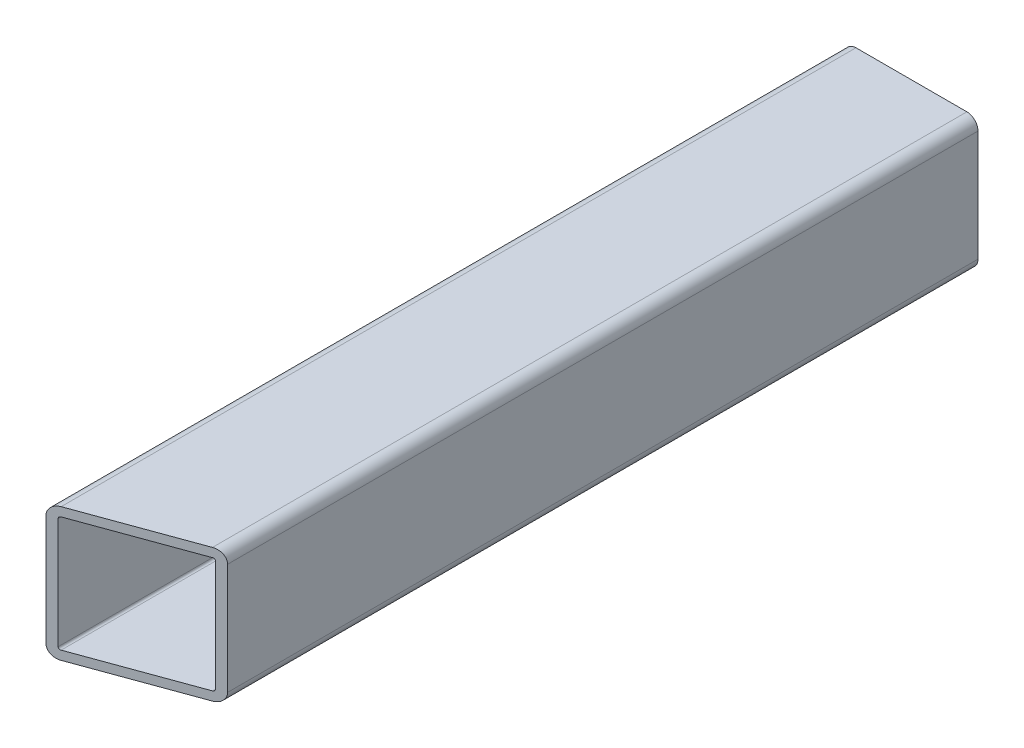
ISO-10303-21;
HEADER;
FILE_DESCRIPTION(('STEP AP214'),'2;1');
FILE_NAME('part.step','',(''),(''),'','','');
FILE_SCHEMA(('AUTOMOTIVE_DESIGN { 1 0 10303 214 1 1 1 1 }'));
ENDSEC;
DATA;
#1=APPLICATION_CONTEXT('core data for automotive mechanical design processes');
#2=APPLICATION_PROTOCOL_DEFINITION('international standard','automotive_design',2000,#1);
#3=PRODUCT_CONTEXT('',#1,'mechanical');
#4=PRODUCT('Part','Part','',(#3));
#5=PRODUCT_RELATED_PRODUCT_CATEGORY('part','',(#4));
#6=PRODUCT_DEFINITION_FORMATION('','',#4);
#7=PRODUCT_DEFINITION_CONTEXT('part definition',#1,'design');
#8=PRODUCT_DEFINITION('design','',#6,#7);
#9=PRODUCT_DEFINITION_SHAPE('','',#8);
#10=(LENGTH_UNIT() NAMED_UNIT(*) SI_UNIT(.MILLI.,.METRE.));
#11=(NAMED_UNIT(*) PLANE_ANGLE_UNIT() SI_UNIT($,.RADIAN.));
#12=(NAMED_UNIT(*) SI_UNIT($,.STERADIAN.) SOLID_ANGLE_UNIT());
#13=UNCERTAINTY_MEASURE_WITH_UNIT(LENGTH_MEASURE(1.E-05),#10,'distance_accuracy_value','');
#14=(GEOMETRIC_REPRESENTATION_CONTEXT(3) GLOBAL_UNCERTAINTY_ASSIGNED_CONTEXT((#13)) GLOBAL_UNIT_ASSIGNED_CONTEXT((#10,
#11,#12)) REPRESENTATION_CONTEXT('',''));
#15=CARTESIAN_POINT('',(0.,0.,0.));
#16=DIRECTION('',(0.,0.,1.));
#17=DIRECTION('',(1.,0.,0.));
#18=AXIS2_PLACEMENT_3D('',#15,#16,#17);
#19=CARTESIAN_POINT('',(-15.875,-15.875,-114.3));
#20=DIRECTION('',(0.,0.,1.));
#21=DIRECTION('',(1.,0.,0.));
#22=AXIS2_PLACEMENT_3D('',#19,#20,#21);
#23=PLANE('',#22);
#24=CARTESIAN_POINT('',(-15.875,-15.875,-114.3));
#25=DIRECTION('',(0.,0.,1.));
#26=DIRECTION('',(1.,0.,0.));
#27=AXIS2_PLACEMENT_3D('',#24,#25,#26);
#28=CIRCLE('',#27,3.175);
#29=CARTESIAN_POINT('',(-19.05,-15.875,-114.3));
#30=VERTEX_POINT('',#29);
#31=CARTESIAN_POINT('',(-15.875,-19.05,-114.3));
#32=VERTEX_POINT('',#31);
#33=EDGE_CURVE('E224',#30,#32,#28,.T.);
#34=ORIENTED_EDGE('',*,*,#33,.F.);
#35=DIRECTION('',(0.,-1.,0.));
#36=VECTOR('',#35,1.);
#37=CARTESIAN_POINT('',(-19.05,15.875,-114.3));
#38=LINE('',#37,#36);
#39=CARTESIAN_POINT('',(-19.05,15.875,-114.3));
#40=VERTEX_POINT('',#39);
#41=EDGE_CURVE('E203',#40,#30,#38,.T.);
#42=ORIENTED_EDGE('',*,*,#41,.F.);
#43=CARTESIAN_POINT('',(-15.875,15.875,-114.3));
#44=DIRECTION('',(0.,0.,1.));
#45=DIRECTION('',(1.,0.,0.));
#46=AXIS2_PLACEMENT_3D('',#43,#44,#45);
#47=CIRCLE('',#46,3.175);
#48=CARTESIAN_POINT('',(-15.875,19.05,-114.3));
#49=VERTEX_POINT('',#48);
#50=EDGE_CURVE('E218',#49,#40,#47,.T.);
#51=ORIENTED_EDGE('',*,*,#50,.F.);
#52=DIRECTION('',(-1.,0.,0.));
#53=VECTOR('',#52,1.);
#54=CARTESIAN_POINT('',(-15.875,19.05,-114.3));
#55=LINE('',#54,#53);
#56=CARTESIAN_POINT('',(15.875,19.05,-114.3));
#57=VERTEX_POINT('',#56);
#58=EDGE_CURVE('E238',#57,#49,#55,.T.);
#59=ORIENTED_EDGE('',*,*,#58,.F.);
#60=CARTESIAN_POINT('',(15.875,15.875,-114.3));
#61=DIRECTION('',(0.,0.,1.));
#62=DIRECTION('',(1.,0.,0.));
#63=AXIS2_PLACEMENT_3D('',#60,#61,#62);
#64=CIRCLE('',#63,3.175);
#65=CARTESIAN_POINT('',(19.05,15.875,-114.3));
#66=VERTEX_POINT('',#65);
#67=EDGE_CURVE('E235',#66,#57,#64,.T.);
#68=ORIENTED_EDGE('',*,*,#67,.F.);
#69=DIRECTION('',(0.,1.,0.));
#70=VECTOR('',#69,1.);
#71=CARTESIAN_POINT('',(19.05,15.875,-114.3));
#72=LINE('',#71,#70);
#73=CARTESIAN_POINT('',(19.05,-15.875,-114.3));
#74=VERTEX_POINT('',#73);
#75=EDGE_CURVE('E232',#74,#66,#72,.T.);
#76=ORIENTED_EDGE('',*,*,#75,.F.);
#77=CARTESIAN_POINT('',(15.875,-15.875,-114.3));
#78=DIRECTION('',(0.,0.,1.));
#79=DIRECTION('',(1.,0.,0.));
#80=AXIS2_PLACEMENT_3D('',#77,#78,#79);
#81=CIRCLE('',#80,3.175);
#82=CARTESIAN_POINT('',(15.875,-19.05,-114.3));
#83=VERTEX_POINT('',#82);
#84=EDGE_CURVE('E229',#83,#74,#81,.T.);
#85=ORIENTED_EDGE('',*,*,#84,.F.);
#86=DIRECTION('',(1.,0.,0.));
#87=VECTOR('',#86,1.);
#88=CARTESIAN_POINT('',(-15.875,-19.05,-114.3));
#89=LINE('',#88,#87);
#90=EDGE_CURVE('E226',#32,#83,#89,.T.);
#91=ORIENTED_EDGE('',*,*,#90,.F.);
#92=EDGE_LOOP('',(#34,#42,#51,#59,#68,#76,#85,#91));
#93=FACE_BOUND('',#92,.T.);
#94=CARTESIAN_POINT('',(-15.875,-15.875,-114.3));
#95=DIRECTION('',(0.,0.,1.));
#96=DIRECTION('',(1.,0.,0.));
#97=AXIS2_PLACEMENT_3D('',#94,#95,#96);
#98=CIRCLE('',#97,0.635000000000002);
#99=CARTESIAN_POINT('',(-16.51,-15.875,-114.3));
#100=VERTEX_POINT('',#99);
#101=CARTESIAN_POINT('',(-15.875,-16.51,-114.3));
#102=VERTEX_POINT('',#101);
#103=EDGE_CURVE('E212',#100,#102,#98,.T.);
#104=ORIENTED_EDGE('',*,*,#103,.T.);
#105=DIRECTION('',(1.,0.,0.));
#106=VECTOR('',#105,1.);
#107=CARTESIAN_POINT('',(-15.875,-16.51,-114.3));
#108=LINE('',#107,#106);
#109=CARTESIAN_POINT('',(15.875,-16.51,-114.3));
#110=VERTEX_POINT('',#109);
#111=EDGE_CURVE('E268',#102,#110,#108,.T.);
#112=ORIENTED_EDGE('',*,*,#111,.T.);
#113=CARTESIAN_POINT('',(15.875,-15.875,-114.3));
#114=DIRECTION('',(0.,0.,1.));
#115=DIRECTION('',(1.,0.,0.));
#116=AXIS2_PLACEMENT_3D('',#113,#114,#115);
#117=CIRCLE('',#116,0.634999999999999);
#118=CARTESIAN_POINT('',(16.51,-15.875,-114.3));
#119=VERTEX_POINT('',#118);
#120=EDGE_CURVE('E271',#110,#119,#117,.T.);
#121=ORIENTED_EDGE('',*,*,#120,.T.);
#122=DIRECTION('',(0.,1.,0.));
#123=VECTOR('',#122,1.);
#124=CARTESIAN_POINT('',(16.51,15.875,-114.3));
#125=LINE('',#124,#123);
#126=CARTESIAN_POINT('',(16.51,15.875,-114.3));
#127=VERTEX_POINT('',#126);
#128=EDGE_CURVE('E274',#119,#127,#125,.T.);
#129=ORIENTED_EDGE('',*,*,#128,.T.);
#130=CARTESIAN_POINT('',(15.875,15.875,-114.3));
#131=DIRECTION('',(0.,0.,1.));
#132=DIRECTION('',(1.,0.,0.));
#133=AXIS2_PLACEMENT_3D('',#130,#131,#132);
#134=CIRCLE('',#133,0.635000000000004);
#135=CARTESIAN_POINT('',(15.875,16.51,-114.3));
#136=VERTEX_POINT('',#135);
#137=EDGE_CURVE('E277',#127,#136,#134,.T.);
#138=ORIENTED_EDGE('',*,*,#137,.T.);
#139=DIRECTION('',(-1.,0.,0.));
#140=VECTOR('',#139,1.);
#141=CARTESIAN_POINT('',(-15.875,16.51,-114.3));
#142=LINE('',#141,#140);
#143=CARTESIAN_POINT('',(-15.875,16.51,-114.3));
#144=VERTEX_POINT('',#143);
#145=EDGE_CURVE('E280',#136,#144,#142,.T.);
#146=ORIENTED_EDGE('',*,*,#145,.T.);
#147=CARTESIAN_POINT('',(-15.875,15.875,-114.3));
#148=DIRECTION('',(0.,0.,1.));
#149=DIRECTION('',(1.,0.,0.));
#150=AXIS2_PLACEMENT_3D('',#147,#148,#149);
#151=CIRCLE('',#150,0.635000000000004);
#152=CARTESIAN_POINT('',(-16.51,15.875,-114.3));
#153=VERTEX_POINT('',#152);
#154=EDGE_CURVE('E283',#144,#153,#151,.T.);
#155=ORIENTED_EDGE('',*,*,#154,.T.);
#156=DIRECTION('',(0.,-1.,0.));
#157=VECTOR('',#156,1.);
#158=CARTESIAN_POINT('',(-16.51,15.875,-114.3));
#159=LINE('',#158,#157);
#160=EDGE_CURVE('E286',#153,#100,#159,.T.);
#161=ORIENTED_EDGE('',*,*,#160,.T.);
#162=EDGE_LOOP('',(#104,#112,#121,#129,#138,#146,#155,#161));
#163=FACE_BOUND('',#162,.T.);
#164=ADVANCED_FACE('F81',(#93,#163),#23,.F.);
#165=CARTESIAN_POINT('',(-15.875,-15.875,114.3));
#166=DIRECTION('',(0.,0.,-1.));
#167=DIRECTION('',(-1.,0.,0.));
#168=AXIS2_PLACEMENT_3D('',#165,#166,#167);
#169=CYLINDRICAL_SURFACE('',#168,3.175);
#170=DIRECTION('',(0.,0.,-1.));
#171=VECTOR('',#170,1.);
#172=CARTESIAN_POINT('',(-15.875,-19.05,114.3));
#173=LINE('',#172,#171);
#174=CARTESIAN_POINT('',(-15.875,-19.05,113.144394506205));
#175=VERTEX_POINT('',#174);
#176=EDGE_CURVE('E89',#175,#32,#173,.T.);
#177=ORIENTED_EDGE('',*,*,#176,.F.);
#178=CARTESIAN_POINT('',(-15.875,-15.875,113.144394506205));
#179=DIRECTION('',(-0.342020143325663,0.,-0.93969262078591));
#180=DIRECTION('',(0.93969262078591,0.,-0.342020143325663));
#181=AXIS2_PLACEMENT_3D('',#178,#179,#180);
#182=ELLIPSE('',#181,3.37876442761102,3.175);
#183=CARTESIAN_POINT('',(-19.05,-15.875,114.3));
#184=VERTEX_POINT('',#183);
#185=EDGE_CURVE('E210',#175,#184,#182,.T.);
#186=ORIENTED_EDGE('',*,*,#185,.T.);
#187=DIRECTION('',(0.,0.,-1.));
#188=VECTOR('',#187,1.);
#189=CARTESIAN_POINT('',(-19.05,-15.875,114.3));
#190=LINE('',#189,#188);
#191=EDGE_CURVE('E195',#184,#30,#190,.T.);
#192=ORIENTED_EDGE('',*,*,#191,.T.);
#193=ORIENTED_EDGE('',*,*,#33,.T.);
#194=EDGE_LOOP('',(#177,#186,#192,#193));
#195=FACE_BOUND('',#194,.T.);
#196=ADVANCED_FACE('F83',(#195),#169,.T.);
#197=CARTESIAN_POINT('',(-15.875,-19.05,114.3));
#198=DIRECTION('',(0.,1.,0.));
#199=DIRECTION('',(0.,0.,1.));
#200=AXIS2_PLACEMENT_3D('',#197,#198,#199);
#201=PLANE('',#200);
#202=DIRECTION('',(0.,0.,-1.));
#203=VECTOR('',#202,1.);
#204=CARTESIAN_POINT('',(15.875,-19.05,114.3));
#205=LINE('',#204,#203);
#206=CARTESIAN_POINT('',(15.875,-19.05,101.588339568253));
#207=VERTEX_POINT('',#206);
#208=EDGE_CURVE('E251',#207,#83,#205,.T.);
#209=ORIENTED_EDGE('',*,*,#208,.F.);
#210=DIRECTION('',(-0.93969262078591,0.,0.342020143325663));
#211=VECTOR('',#210,1.);
#212=CARTESIAN_POINT('',(-16.2464044465486,-19.05,113.279574669623));
#213=LINE('',#212,#211);
#214=EDGE_CURVE('E96',#207,#175,#213,.T.);
#215=ORIENTED_EDGE('',*,*,#214,.T.);
#216=ORIENTED_EDGE('',*,*,#176,.T.);
#217=ORIENTED_EDGE('',*,*,#90,.T.);
#218=EDGE_LOOP('',(#209,#215,#216,#217));
#219=FACE_BOUND('',#218,.T.);
#220=ADVANCED_FACE('F253',(#219),#201,.F.);
#221=CARTESIAN_POINT('',(15.875,-15.875,114.3));
#222=DIRECTION('',(0.,0.,-1.));
#223=DIRECTION('',(-1.,0.,0.));
#224=AXIS2_PLACEMENT_3D('',#221,#222,#223);
#225=CYLINDRICAL_SURFACE('',#224,3.175);
#226=DIRECTION('',(0.,0.,-1.));
#227=VECTOR('',#226,1.);
#228=CARTESIAN_POINT('',(19.05,-15.875,114.3));
#229=LINE('',#228,#227);
#230=CARTESIAN_POINT('',(19.05,-15.875,100.432734074458));
#231=VERTEX_POINT('',#230);
#232=EDGE_CURVE('E249',#231,#74,#229,.T.);
#233=ORIENTED_EDGE('',*,*,#232,.F.);
#234=CARTESIAN_POINT('',(15.875,-15.875,101.588339568253));
#235=DIRECTION('',(-0.342020143325663,0.,-0.93969262078591));
#236=DIRECTION('',(0.93969262078591,0.,-0.342020143325663));
#237=AXIS2_PLACEMENT_3D('',#234,#235,#236);
#238=ELLIPSE('',#237,3.37876442761101,3.175);
#239=EDGE_CURVE('E104',#231,#207,#238,.T.);
#240=ORIENTED_EDGE('',*,*,#239,.T.);
#241=ORIENTED_EDGE('',*,*,#208,.T.);
#242=ORIENTED_EDGE('',*,*,#84,.T.);
#243=EDGE_LOOP('',(#233,#240,#241,#242));
#244=FACE_BOUND('',#243,.T.);
#245=ADVANCED_FACE('F259',(#244),#225,.T.);
#246=CARTESIAN_POINT('',(19.05,15.875,114.3));
#247=DIRECTION('',(-1.,0.,0.));
#248=DIRECTION('',(0.,-1.,0.));
#249=AXIS2_PLACEMENT_3D('',#246,#247,#248);
#250=PLANE('',#249);
#251=DIRECTION('',(0.,0.,-1.));
#252=VECTOR('',#251,1.);
#253=CARTESIAN_POINT('',(19.05,15.875,114.3));
#254=LINE('',#253,#252);
#255=CARTESIAN_POINT('',(19.05,15.875,100.432734074458));
#256=VERTEX_POINT('',#255);
#257=EDGE_CURVE('E247',#256,#66,#254,.T.);
#258=ORIENTED_EDGE('',*,*,#257,.F.);
#259=DIRECTION('',(0.,-1.,0.));
#260=VECTOR('',#259,1.);
#261=CARTESIAN_POINT('',(19.05,360.255216891398,100.432734074458));
#262=LINE('',#261,#260);
#263=EDGE_CURVE('E337',#256,#231,#262,.T.);
#264=ORIENTED_EDGE('',*,*,#263,.T.);
#265=ORIENTED_EDGE('',*,*,#232,.T.);
#266=ORIENTED_EDGE('',*,*,#75,.T.);
#267=EDGE_LOOP('',(#258,#264,#265,#266));
#268=FACE_BOUND('',#267,.T.);
#269=ADVANCED_FACE('F336',(#268),#250,.F.);
#270=CARTESIAN_POINT('',(15.875,15.875,114.3));
#271=DIRECTION('',(0.,0.,-1.));
#272=DIRECTION('',(-1.,0.,0.));
#273=AXIS2_PLACEMENT_3D('',#270,#271,#272);
#274=CYLINDRICAL_SURFACE('',#273,3.175);
#275=DIRECTION('',(0.,0.,-1.));
#276=VECTOR('',#275,1.);
#277=CARTESIAN_POINT('',(15.875,19.05,114.3));
#278=LINE('',#277,#276);
#279=CARTESIAN_POINT('',(15.875,19.05,101.588339568253));
#280=VERTEX_POINT('',#279);
#281=EDGE_CURVE('E245',#280,#57,#278,.T.);
#282=ORIENTED_EDGE('',*,*,#281,.F.);
#283=CARTESIAN_POINT('',(15.875,15.875,101.588339568253));
#284=DIRECTION('',(-0.342020143325663,0.,-0.93969262078591));
#285=DIRECTION('',(0.93969262078591,0.,-0.342020143325663));
#286=AXIS2_PLACEMENT_3D('',#283,#284,#285);
#287=ELLIPSE('',#286,3.37876442761102,3.175);
#288=EDGE_CURVE('E262',#280,#256,#287,.T.);
#289=ORIENTED_EDGE('',*,*,#288,.T.);
#290=ORIENTED_EDGE('',*,*,#257,.T.);
#291=ORIENTED_EDGE('',*,*,#67,.T.);
#292=EDGE_LOOP('',(#282,#289,#290,#291));
#293=FACE_BOUND('',#292,.T.);
#294=ADVANCED_FACE('F334',(#293),#274,.T.);
#295=CARTESIAN_POINT('',(-15.875,19.05,114.3));
#296=DIRECTION('',(0.,-1.,0.));
#297=DIRECTION('',(0.,0.,-1.));
#298=AXIS2_PLACEMENT_3D('',#295,#296,#297);
#299=PLANE('',#298);
#300=DIRECTION('',(0.,0.,-1.));
#301=VECTOR('',#300,1.);
#302=CARTESIAN_POINT('',(-15.875,19.05,114.3));
#303=LINE('',#302,#301);
#304=CARTESIAN_POINT('',(-15.875,19.05,113.144394506205));
#305=VERTEX_POINT('',#304);
#306=EDGE_CURVE('E243',#305,#49,#303,.T.);
#307=ORIENTED_EDGE('',*,*,#306,.F.);
#308=DIRECTION('',(0.93969262078591,0.,-0.342020143325663));
#309=VECTOR('',#308,1.);
#310=CARTESIAN_POINT('',(-16.2464044465486,19.05,113.279574669623));
#311=LINE('',#310,#309);
#312=EDGE_CURVE('E324',#305,#280,#311,.T.);
#313=ORIENTED_EDGE('',*,*,#312,.T.);
#314=ORIENTED_EDGE('',*,*,#281,.T.);
#315=ORIENTED_EDGE('',*,*,#58,.T.);
#316=EDGE_LOOP('',(#307,#313,#314,#315));
#317=FACE_BOUND('',#316,.T.);
#318=ADVANCED_FACE('F388',(#317),#299,.F.);
#319=CARTESIAN_POINT('',(-15.875,15.875,114.3));
#320=DIRECTION('',(0.,0.,-1.));
#321=DIRECTION('',(-1.,0.,0.));
#322=AXIS2_PLACEMENT_3D('',#319,#320,#321);
#323=CYLINDRICAL_SURFACE('',#322,3.175);
#324=DIRECTION('',(0.,0.,-1.));
#325=VECTOR('',#324,1.);
#326=CARTESIAN_POINT('',(-19.05,15.875,114.3));
#327=LINE('',#326,#325);
#328=CARTESIAN_POINT('',(-19.05,15.875,114.3));
#329=VERTEX_POINT('',#328);
#330=EDGE_CURVE('E207',#329,#40,#327,.T.);
#331=ORIENTED_EDGE('',*,*,#330,.F.);
#332=CARTESIAN_POINT('',(-15.875,15.875,113.144394506205));
#333=DIRECTION('',(-0.342020143325663,0.,-0.93969262078591));
#334=DIRECTION('',(0.93969262078591,0.,-0.342020143325663));
#335=AXIS2_PLACEMENT_3D('',#332,#333,#334);
#336=ELLIPSE('',#335,3.37876442761102,3.175);
#337=EDGE_CURVE('E216',#329,#305,#336,.T.);
#338=ORIENTED_EDGE('',*,*,#337,.T.);
#339=ORIENTED_EDGE('',*,*,#306,.T.);
#340=ORIENTED_EDGE('',*,*,#50,.T.);
#341=EDGE_LOOP('',(#331,#338,#339,#340));
#342=FACE_BOUND('',#341,.T.);
#343=ADVANCED_FACE('F385',(#342),#323,.T.);
#344=CARTESIAN_POINT('',(-19.05,15.875,114.3));
#345=DIRECTION('',(1.,0.,0.));
#346=DIRECTION('',(0.,1.,0.));
#347=AXIS2_PLACEMENT_3D('',#344,#345,#346);
#348=PLANE('',#347);
#349=ORIENTED_EDGE('',*,*,#41,.T.);
#350=ORIENTED_EDGE('',*,*,#191,.F.);
#351=DIRECTION('',(0.,-1.,0.));
#352=VECTOR('',#351,1.);
#353=CARTESIAN_POINT('',(-19.05,15.875,114.3));
#354=LINE('',#353,#352);
#355=EDGE_CURVE('E200',#329,#184,#354,.T.);
#356=ORIENTED_EDGE('',*,*,#355,.F.);
#357=ORIENTED_EDGE('',*,*,#330,.T.);
#358=EDGE_LOOP('',(#349,#350,#356,#357));
#359=FACE_BOUND('',#358,.T.);
#360=ADVANCED_FACE('F197',(#359),#348,.F.);
#361=CARTESIAN_POINT('',(-15.875,-15.875,114.3));
#362=DIRECTION('',(0.,0.,-1.));
#363=DIRECTION('',(-1.,0.,0.));
#364=AXIS2_PLACEMENT_3D('',#361,#362,#363);
#365=CYLINDRICAL_SURFACE('',#364,0.635000000000002);
#366=CARTESIAN_POINT('',(-15.875,-15.875,113.144394506205));
#367=DIRECTION('',(-0.342020143325663,0.,-0.93969262078591));
#368=DIRECTION('',(0.93969262078591,0.,-0.342020143325663));
#369=AXIS2_PLACEMENT_3D('',#366,#367,#368);
#370=ELLIPSE('',#369,0.675752885522205,0.635000000000002);
#371=CARTESIAN_POINT('',(-15.875,-16.51,113.144394506205));
#372=VERTEX_POINT('',#371);
#373=CARTESIAN_POINT('',(-16.51,-15.875,113.375515604964));
#374=VERTEX_POINT('',#373);
#375=EDGE_CURVE('E311',#372,#374,#370,.T.);
#376=ORIENTED_EDGE('',*,*,#375,.F.);
#377=DIRECTION('',(0.,0.,-1.));
#378=VECTOR('',#377,1.);
#379=CARTESIAN_POINT('',(-15.875,-16.51,114.3));
#380=LINE('',#379,#378);
#381=EDGE_CURVE('E222',#372,#102,#380,.T.);
#382=ORIENTED_EDGE('',*,*,#381,.T.);
#383=ORIENTED_EDGE('',*,*,#103,.F.);
#384=DIRECTION('',(0.,0.,-1.));
#385=VECTOR('',#384,1.);
#386=CARTESIAN_POINT('',(-16.51,-15.875,114.3));
#387=LINE('',#386,#385);
#388=EDGE_CURVE('E289',#374,#100,#387,.T.);
#389=ORIENTED_EDGE('',*,*,#388,.F.);
#390=EDGE_LOOP('',(#376,#382,#383,#389));
#391=FACE_BOUND('',#390,.T.);
#392=ADVANCED_FACE('F308',(#391),#365,.F.);
#393=CARTESIAN_POINT('',(-15.875,-16.51,114.3));
#394=DIRECTION('',(0.,1.,0.));
#395=DIRECTION('',(0.,0.,1.));
#396=AXIS2_PLACEMENT_3D('',#393,#394,#395);
#397=PLANE('',#396);
#398=DIRECTION('',(-0.93969262078591,0.,0.342020143325663));
#399=VECTOR('',#398,1.);
#400=CARTESIAN_POINT('',(-16.2464044465486,-16.51,113.279574669623));
#401=LINE('',#400,#399);
#402=CARTESIAN_POINT('',(15.875,-16.51,101.588339568253));
#403=VERTEX_POINT('',#402);
#404=EDGE_CURVE('E322',#403,#372,#401,.T.);
#405=ORIENTED_EDGE('',*,*,#404,.F.);
#406=DIRECTION('',(0.,0.,-1.));
#407=VECTOR('',#406,1.);
#408=CARTESIAN_POINT('',(15.875,-16.51,114.3));
#409=LINE('',#408,#407);
#410=EDGE_CURVE('E300',#403,#110,#409,.T.);
#411=ORIENTED_EDGE('',*,*,#410,.T.);
#412=ORIENTED_EDGE('',*,*,#111,.F.);
#413=ORIENTED_EDGE('',*,*,#381,.F.);
#414=EDGE_LOOP('',(#405,#411,#412,#413));
#415=FACE_BOUND('',#414,.T.);
#416=ADVANCED_FACE('F313',(#415),#397,.T.);
#417=CARTESIAN_POINT('',(15.875,-15.875,114.3));
#418=DIRECTION('',(0.,0.,-1.));
#419=DIRECTION('',(-1.,0.,0.));
#420=AXIS2_PLACEMENT_3D('',#417,#418,#419);
#421=CYLINDRICAL_SURFACE('',#420,0.634999999999999);
#422=CARTESIAN_POINT('',(15.875,-15.875,101.588339568253));
#423=DIRECTION('',(-0.342020143325663,0.,-0.93969262078591));
#424=DIRECTION('',(0.93969262078591,0.,-0.342020143325663));
#425=AXIS2_PLACEMENT_3D('',#422,#423,#424);
#426=ELLIPSE('',#425,0.675752885522201,0.634999999999999);
#427=CARTESIAN_POINT('',(16.51,-15.875,101.357218469494));
#428=VERTEX_POINT('',#427);
#429=EDGE_CURVE('E326',#428,#403,#426,.T.);
#430=ORIENTED_EDGE('',*,*,#429,.F.);
#431=DIRECTION('',(0.,0.,-1.));
#432=VECTOR('',#431,1.);
#433=CARTESIAN_POINT('',(16.51,-15.875,114.3));
#434=LINE('',#433,#432);
#435=EDGE_CURVE('E299',#428,#119,#434,.T.);
#436=ORIENTED_EDGE('',*,*,#435,.T.);
#437=ORIENTED_EDGE('',*,*,#120,.F.);
#438=ORIENTED_EDGE('',*,*,#410,.F.);
#439=EDGE_LOOP('',(#430,#436,#437,#438));
#440=FACE_BOUND('',#439,.T.);
#441=ADVANCED_FACE('F352',(#440),#421,.F.);
#442=CARTESIAN_POINT('',(16.51,15.875,114.3));
#443=DIRECTION('',(-1.,0.,0.));
#444=DIRECTION('',(0.,-1.,0.));
#445=AXIS2_PLACEMENT_3D('',#442,#443,#444);
#446=PLANE('',#445);
#447=DIRECTION('',(0.,-1.,0.));
#448=VECTOR('',#447,1.);
#449=CARTESIAN_POINT('',(16.51,15.875,101.357218469494));
#450=LINE('',#449,#448);
#451=CARTESIAN_POINT('',(16.51,15.875,101.357218469494));
#452=VERTEX_POINT('',#451);
#453=EDGE_CURVE('E348',#452,#428,#450,.T.);
#454=ORIENTED_EDGE('',*,*,#453,.F.);
#455=DIRECTION('',(0.,0.,-1.));
#456=VECTOR('',#455,1.);
#457=CARTESIAN_POINT('',(16.51,15.875,114.3));
#458=LINE('',#457,#456);
#459=EDGE_CURVE('E297',#452,#127,#458,.T.);
#460=ORIENTED_EDGE('',*,*,#459,.T.);
#461=ORIENTED_EDGE('',*,*,#128,.F.);
#462=ORIENTED_EDGE('',*,*,#435,.F.);
#463=EDGE_LOOP('',(#454,#460,#461,#462));
#464=FACE_BOUND('',#463,.T.);
#465=ADVANCED_FACE('F355',(#464),#446,.T.);
#466=CARTESIAN_POINT('',(15.875,15.875,114.3));
#467=DIRECTION('',(0.,0.,-1.));
#468=DIRECTION('',(-1.,0.,0.));
#469=AXIS2_PLACEMENT_3D('',#466,#467,#468);
#470=CYLINDRICAL_SURFACE('',#469,0.635000000000004);
#471=CARTESIAN_POINT('',(15.875,15.875,101.588339568253));
#472=DIRECTION('',(-0.342020143325663,0.,-0.93969262078591));
#473=DIRECTION('',(0.93969262078591,0.,-0.342020143325663));
#474=AXIS2_PLACEMENT_3D('',#471,#472,#473);
#475=ELLIPSE('',#474,0.675752885522207,0.635000000000004);
#476=CARTESIAN_POINT('',(15.875,16.51,101.588339568253));
#477=VERTEX_POINT('',#476);
#478=EDGE_CURVE('E345',#477,#452,#475,.T.);
#479=ORIENTED_EDGE('',*,*,#478,.F.);
#480=DIRECTION('',(0.,0.,-1.));
#481=VECTOR('',#480,1.);
#482=CARTESIAN_POINT('',(15.875,16.51,114.3));
#483=LINE('',#482,#481);
#484=EDGE_CURVE('E295',#477,#136,#483,.T.);
#485=ORIENTED_EDGE('',*,*,#484,.T.);
#486=ORIENTED_EDGE('',*,*,#137,.F.);
#487=ORIENTED_EDGE('',*,*,#459,.F.);
#488=EDGE_LOOP('',(#479,#485,#486,#487));
#489=FACE_BOUND('',#488,.T.);
#490=ADVANCED_FACE('F360',(#489),#470,.F.);
#491=CARTESIAN_POINT('',(-15.875,16.51,114.3));
#492=DIRECTION('',(0.,-1.,0.));
#493=DIRECTION('',(0.,0.,-1.));
#494=AXIS2_PLACEMENT_3D('',#491,#492,#493);
#495=PLANE('',#494);
#496=DIRECTION('',(0.93969262078591,0.,-0.342020143325663));
#497=VECTOR('',#496,1.);
#498=CARTESIAN_POINT('',(-16.2464044465486,16.51,113.279574669623));
#499=LINE('',#498,#497);
#500=CARTESIAN_POINT('',(-15.875,16.51,113.144394506205));
#501=VERTEX_POINT('',#500);
#502=EDGE_CURVE('E340',#501,#477,#499,.T.);
#503=ORIENTED_EDGE('',*,*,#502,.F.);
#504=DIRECTION('',(0.,0.,-1.));
#505=VECTOR('',#504,1.);
#506=CARTESIAN_POINT('',(-15.875,16.51,114.3));
#507=LINE('',#506,#505);
#508=EDGE_CURVE('E293',#501,#144,#507,.T.);
#509=ORIENTED_EDGE('',*,*,#508,.T.);
#510=ORIENTED_EDGE('',*,*,#145,.F.);
#511=ORIENTED_EDGE('',*,*,#484,.F.);
#512=EDGE_LOOP('',(#503,#509,#510,#511));
#513=FACE_BOUND('',#512,.T.);
#514=ADVANCED_FACE('F363',(#513),#495,.T.);
#515=CARTESIAN_POINT('',(-15.875,15.875,114.3));
#516=DIRECTION('',(0.,0.,-1.));
#517=DIRECTION('',(-1.,0.,0.));
#518=AXIS2_PLACEMENT_3D('',#515,#516,#517);
#519=CYLINDRICAL_SURFACE('',#518,0.635000000000004);
#520=CARTESIAN_POINT('',(-15.875,15.875,113.144394506205));
#521=DIRECTION('',(-0.342020143325663,0.,-0.93969262078591));
#522=DIRECTION('',(0.93969262078591,0.,-0.342020143325663));
#523=AXIS2_PLACEMENT_3D('',#520,#521,#522);
#524=ELLIPSE('',#523,0.675752885522207,0.635000000000004);
#525=CARTESIAN_POINT('',(-16.51,15.875,113.375515604964));
#526=VERTEX_POINT('',#525);
#527=EDGE_CURVE('E338',#526,#501,#524,.T.);
#528=ORIENTED_EDGE('',*,*,#527,.F.);
#529=DIRECTION('',(0.,0.,-1.));
#530=VECTOR('',#529,1.);
#531=CARTESIAN_POINT('',(-16.51,15.875,114.3));
#532=LINE('',#531,#530);
#533=EDGE_CURVE('E291',#526,#153,#532,.T.);
#534=ORIENTED_EDGE('',*,*,#533,.T.);
#535=ORIENTED_EDGE('',*,*,#154,.F.);
#536=ORIENTED_EDGE('',*,*,#508,.F.);
#537=EDGE_LOOP('',(#528,#534,#535,#536));
#538=FACE_BOUND('',#537,.T.);
#539=ADVANCED_FACE('F366',(#538),#519,.F.);
#540=CARTESIAN_POINT('',(-16.51,15.875,114.3));
#541=DIRECTION('',(1.,0.,0.));
#542=DIRECTION('',(0.,1.,0.));
#543=AXIS2_PLACEMENT_3D('',#540,#541,#542);
#544=PLANE('',#543);
#545=DIRECTION('',(0.,1.,0.));
#546=VECTOR('',#545,1.);
#547=CARTESIAN_POINT('',(-16.51,15.875,113.375515604964));
#548=LINE('',#547,#546);
#549=EDGE_CURVE('E12',#374,#526,#548,.T.);
#550=ORIENTED_EDGE('',*,*,#549,.F.);
#551=ORIENTED_EDGE('',*,*,#388,.T.);
#552=ORIENTED_EDGE('',*,*,#160,.F.);
#553=ORIENTED_EDGE('',*,*,#533,.F.);
#554=EDGE_LOOP('',(#550,#551,#552,#553));
#555=FACE_BOUND('',#554,.T.);
#556=ADVANCED_FACE('F317',(#555),#544,.T.);
#557=CARTESIAN_POINT('',(-19.05,360.255216891398,114.3));
#558=DIRECTION('',(-0.342020143325663,0.,-0.93969262078591));
#559=DIRECTION('',(-0.93969262078591,0.,0.342020143325663));
#560=AXIS2_PLACEMENT_3D('',#557,#558,#559);
#561=PLANE('',#560);
#562=ORIENTED_EDGE('',*,*,#404,.T.);
#563=ORIENTED_EDGE('',*,*,#375,.T.);
#564=ORIENTED_EDGE('',*,*,#549,.T.);
#565=ORIENTED_EDGE('',*,*,#527,.T.);
#566=ORIENTED_EDGE('',*,*,#502,.T.);
#567=ORIENTED_EDGE('',*,*,#478,.T.);
#568=ORIENTED_EDGE('',*,*,#453,.T.);
#569=ORIENTED_EDGE('',*,*,#429,.T.);
#570=EDGE_LOOP('',(#562,#563,#564,#565,#566,#567,#568,#569));
#571=FACE_BOUND('',#570,.T.);
#572=ORIENTED_EDGE('',*,*,#185,.F.);
#573=ORIENTED_EDGE('',*,*,#214,.F.);
#574=ORIENTED_EDGE('',*,*,#239,.F.);
#575=ORIENTED_EDGE('',*,*,#263,.F.);
#576=ORIENTED_EDGE('',*,*,#288,.F.);
#577=ORIENTED_EDGE('',*,*,#312,.F.);
#578=ORIENTED_EDGE('',*,*,#337,.F.);
#579=ORIENTED_EDGE('',*,*,#355,.T.);
#580=EDGE_LOOP('',(#572,#573,#574,#575,#576,#577,#578,#579));
#581=FACE_BOUND('',#580,.T.);
#582=ADVANCED_FACE('F214',(#571,#581),#561,.F.);
#583=CLOSED_SHELL('',(#164,#196,#220,#245,#269,#294,#318,#343,#360,#392,#416,#441,#465,#490,
#514,#539,#556,#582));
#584=MANIFOLD_SOLID_BREP('B2',#583);
#585=ADVANCED_BREP_SHAPE_REPRESENTATION('',(#18,#584),#14);
#586=SHAPE_DEFINITION_REPRESENTATION(#9,#585);
ENDSEC;
END-ISO-10303-21;
